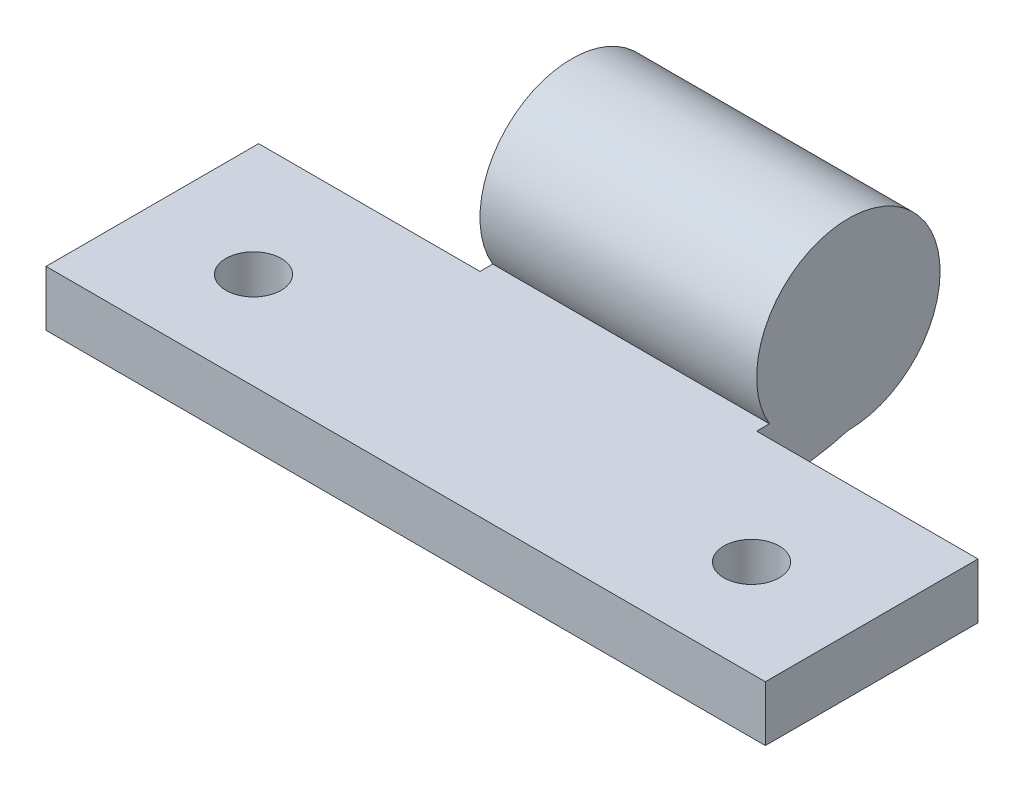
ISO-10303-21;
HEADER;
FILE_DESCRIPTION(('STEP AP214'),'2;1');
FILE_NAME('part.step','',(''),(''),'','','');
FILE_SCHEMA(('AUTOMOTIVE_DESIGN { 1 0 10303 214 1 1 1 1 }'));
ENDSEC;
DATA;
#1=APPLICATION_CONTEXT('core data for automotive mechanical design processes');
#2=APPLICATION_PROTOCOL_DEFINITION('international standard','automotive_design',2000,#1);
#3=PRODUCT_CONTEXT('',#1,'mechanical');
#4=PRODUCT('Part','Part','',(#3));
#5=PRODUCT_RELATED_PRODUCT_CATEGORY('part','',(#4));
#6=PRODUCT_DEFINITION_FORMATION('','',#4);
#7=PRODUCT_DEFINITION_CONTEXT('part definition',#1,'design');
#8=PRODUCT_DEFINITION('design','',#6,#7);
#9=PRODUCT_DEFINITION_SHAPE('','',#8);
#10=(LENGTH_UNIT() NAMED_UNIT(*) SI_UNIT(.MILLI.,.METRE.));
#11=(NAMED_UNIT(*) PLANE_ANGLE_UNIT() SI_UNIT($,.RADIAN.));
#12=(NAMED_UNIT(*) SI_UNIT($,.STERADIAN.) SOLID_ANGLE_UNIT());
#13=UNCERTAINTY_MEASURE_WITH_UNIT(LENGTH_MEASURE(1.E-05),#10,'distance_accuracy_value','');
#14=(GEOMETRIC_REPRESENTATION_CONTEXT(3) GLOBAL_UNCERTAINTY_ASSIGNED_CONTEXT((#13)) GLOBAL_UNIT_ASSIGNED_CONTEXT((#10,
#11,#12)) REPRESENTATION_CONTEXT('',''));
#15=CARTESIAN_POINT('',(0.,0.,0.));
#16=DIRECTION('',(0.,0.,1.));
#17=DIRECTION('',(1.,0.,0.));
#18=AXIS2_PLACEMENT_3D('',#15,#16,#17);
#19=CARTESIAN_POINT('',(0.,2.,0.));
#20=DIRECTION('',(0.,1.,0.));
#21=DIRECTION('',(0.,0.,1.));
#22=AXIS2_PLACEMENT_3D('',#19,#20,#21);
#23=PLANE('',#22);
#24=DIRECTION('',(1.,0.,0.));
#25=VECTOR('',#24,1.);
#26=CARTESIAN_POINT('',(0.,2.,3.315));
#27=LINE('',#26,#25);
#28=CARTESIAN_POINT('',(5.,2.,3.315));
#29=VERTEX_POINT('',#28);
#30=CARTESIAN_POINT('',(13.,2.,3.315));
#31=VERTEX_POINT('',#30);
#32=EDGE_CURVE('E115',#29,#31,#27,.T.);
#33=ORIENTED_EDGE('',*,*,#32,.F.);
#34=DIRECTION('',(0.,0.,1.));
#35=VECTOR('',#34,1.);
#36=CARTESIAN_POINT('',(5.,2.,0.));
#37=LINE('',#36,#35);
#38=CARTESIAN_POINT('',(5.,2.,2.85482048472404));
#39=VERTEX_POINT('',#38);
#40=EDGE_CURVE('E172',#39,#29,#37,.T.);
#41=ORIENTED_EDGE('',*,*,#40,.F.);
#42=DIRECTION('',(1.,0.,0.));
#43=VECTOR('',#42,1.);
#44=CARTESIAN_POINT('',(-22.3762359185336,2.,2.85482048472404));
#45=LINE('',#44,#43);
#46=CARTESIAN_POINT('',(-5.,2.,2.85482048472404));
#47=VERTEX_POINT('',#46);
#48=EDGE_CURVE('E181',#47,#39,#45,.T.);
#49=ORIENTED_EDGE('',*,*,#48,.F.);
#50=DIRECTION('',(0.,0.,-1.));
#51=VECTOR('',#50,1.);
#52=CARTESIAN_POINT('',(-5.,2.,0.));
#53=LINE('',#52,#51);
#54=CARTESIAN_POINT('',(-5.,2.,3.315));
#55=VERTEX_POINT('',#54);
#56=EDGE_CURVE('E175',#55,#47,#53,.T.);
#57=ORIENTED_EDGE('',*,*,#56,.F.);
#58=DIRECTION('',(1.,0.,0.));
#59=VECTOR('',#58,1.);
#60=CARTESIAN_POINT('',(0.,2.,3.315));
#61=LINE('',#60,#59);
#62=CARTESIAN_POINT('',(-13.,2.,3.315));
#63=VERTEX_POINT('',#62);
#64=EDGE_CURVE('E182',#63,#55,#61,.T.);
#65=ORIENTED_EDGE('',*,*,#64,.F.);
#66=DIRECTION('',(0.,0.,1.));
#67=VECTOR('',#66,1.);
#68=CARTESIAN_POINT('',(-13.,2.,11.));
#69=LINE('',#68,#67);
#70=CARTESIAN_POINT('',(-13.,2.,11.));
#71=VERTEX_POINT('',#70);
#72=EDGE_CURVE('E197',#63,#71,#69,.T.);
#73=ORIENTED_EDGE('',*,*,#72,.T.);
#74=DIRECTION('',(1.,0.,0.));
#75=VECTOR('',#74,1.);
#76=CARTESIAN_POINT('',(-13.,2.,11.));
#77=LINE('',#76,#75);
#78=CARTESIAN_POINT('',(13.,2.,11.));
#79=VERTEX_POINT('',#78);
#80=EDGE_CURVE('E144',#71,#79,#77,.T.);
#81=ORIENTED_EDGE('',*,*,#80,.T.);
#82=DIRECTION('',(0.,0.,-1.));
#83=VECTOR('',#82,1.);
#84=CARTESIAN_POINT('',(13.,2.,11.));
#85=LINE('',#84,#83);
#86=EDGE_CURVE('E148',#79,#31,#85,.T.);
#87=ORIENTED_EDGE('',*,*,#86,.T.);
#88=EDGE_LOOP('',(#33,#41,#49,#57,#65,#73,#81,#87));
#89=FACE_BOUND('',#88,.T.);
#90=CARTESIAN_POINT('',(9.,2.,7.5));
#91=DIRECTION('',(0.,1.,0.));
#92=DIRECTION('',(0.,0.,1.));
#93=AXIS2_PLACEMENT_3D('',#90,#91,#92);
#94=CIRCLE('',#93,1.);
#95=CARTESIAN_POINT('',(9.,2.,8.5));
#96=VERTEX_POINT('',#95);
#97=EDGE_CURVE('E136',#96,#96,#94,.T.);
#98=ORIENTED_EDGE('',*,*,#97,.F.);
#99=EDGE_LOOP('',(#98));
#100=FACE_BOUND('',#99,.T.);
#101=CARTESIAN_POINT('',(-9.,2.,7.5));
#102=DIRECTION('',(0.,1.,0.));
#103=DIRECTION('',(0.,0.,-1.));
#104=AXIS2_PLACEMENT_3D('',#101,#102,#103);
#105=CIRCLE('',#104,1.);
#106=CARTESIAN_POINT('',(-9.,2.,6.5));
#107=VERTEX_POINT('',#106);
#108=EDGE_CURVE('E188',#107,#107,#105,.T.);
#109=ORIENTED_EDGE('',*,*,#108,.F.);
#110=EDGE_LOOP('',(#109));
#111=FACE_BOUND('',#110,.T.);
#112=ADVANCED_FACE('F38',(#89,#100,#111),#23,.T.);
#113=CARTESIAN_POINT('',(0.,0.,0.));
#114=DIRECTION('',(0.,1.,0.));
#115=DIRECTION('',(0.,0.,1.));
#116=AXIS2_PLACEMENT_3D('',#113,#114,#115);
#117=PLANE('',#116);
#118=DIRECTION('',(0.,0.,1.));
#119=VECTOR('',#118,1.);
#120=CARTESIAN_POINT('',(5.,0.,3.315));
#121=LINE('',#120,#119);
#122=CARTESIAN_POINT('',(5.,0.,2.69501391462086));
#123=VERTEX_POINT('',#122);
#124=CARTESIAN_POINT('',(5.,0.,3.315));
#125=VERTEX_POINT('',#124);
#126=EDGE_CURVE('E60',#123,#125,#121,.T.);
#127=ORIENTED_EDGE('',*,*,#126,.T.);
#128=DIRECTION('',(1.,0.,0.));
#129=VECTOR('',#128,1.);
#130=CARTESIAN_POINT('',(13.,0.,3.315));
#131=LINE('',#130,#129);
#132=CARTESIAN_POINT('',(13.,0.,3.315));
#133=VERTEX_POINT('',#132);
#134=EDGE_CURVE('E113',#125,#133,#131,.T.);
#135=ORIENTED_EDGE('',*,*,#134,.T.);
#136=DIRECTION('',(0.,0.,-1.));
#137=VECTOR('',#136,1.);
#138=CARTESIAN_POINT('',(13.,0.,11.));
#139=LINE('',#138,#137);
#140=CARTESIAN_POINT('',(13.,0.,11.));
#141=VERTEX_POINT('',#140);
#142=EDGE_CURVE('E127',#141,#133,#139,.T.);
#143=ORIENTED_EDGE('',*,*,#142,.F.);
#144=DIRECTION('',(1.,0.,0.));
#145=VECTOR('',#144,1.);
#146=CARTESIAN_POINT('',(-13.,0.,11.));
#147=LINE('',#146,#145);
#148=CARTESIAN_POINT('',(-13.,0.,11.));
#149=VERTEX_POINT('',#148);
#150=EDGE_CURVE('E138',#149,#141,#147,.T.);
#151=ORIENTED_EDGE('',*,*,#150,.F.);
#152=DIRECTION('',(0.,0.,1.));
#153=VECTOR('',#152,1.);
#154=CARTESIAN_POINT('',(-13.,0.,11.));
#155=LINE('',#154,#153);
#156=CARTESIAN_POINT('',(-13.,0.,3.315));
#157=VERTEX_POINT('',#156);
#158=EDGE_CURVE('E135',#157,#149,#155,.T.);
#159=ORIENTED_EDGE('',*,*,#158,.F.);
#160=DIRECTION('',(1.,0.,0.));
#161=VECTOR('',#160,1.);
#162=CARTESIAN_POINT('',(-13.,0.,3.315));
#163=LINE('',#162,#161);
#164=CARTESIAN_POINT('',(-5.,0.,3.315));
#165=VERTEX_POINT('',#164);
#166=EDGE_CURVE('E165',#157,#165,#163,.T.);
#167=ORIENTED_EDGE('',*,*,#166,.T.);
#168=DIRECTION('',(0.,0.,-1.));
#169=VECTOR('',#168,1.);
#170=CARTESIAN_POINT('',(-5.,0.,3.315));
#171=LINE('',#170,#169);
#172=CARTESIAN_POINT('',(-5.,0.,2.69501391462086));
#173=VERTEX_POINT('',#172);
#174=EDGE_CURVE('E158',#165,#173,#171,.T.);
#175=ORIENTED_EDGE('',*,*,#174,.T.);
#176=DIRECTION('',(1.,0.,0.));
#177=VECTOR('',#176,1.);
#178=CARTESIAN_POINT('',(0.,0.,2.69501391462086));
#179=LINE('',#178,#177);
#180=EDGE_CURVE('E153',#173,#123,#179,.T.);
#181=ORIENTED_EDGE('',*,*,#180,.T.);
#182=EDGE_LOOP('',(#127,#135,#143,#151,#159,#167,#175,#181));
#183=FACE_BOUND('',#182,.T.);
#184=CARTESIAN_POINT('',(9.,0.,7.5));
#185=DIRECTION('',(0.,1.,0.));
#186=DIRECTION('',(0.,0.,1.));
#187=AXIS2_PLACEMENT_3D('',#184,#185,#186);
#188=CIRCLE('',#187,1.);
#189=CARTESIAN_POINT('',(9.,0.,8.5));
#190=VERTEX_POINT('',#189);
#191=EDGE_CURVE('E141',#190,#190,#188,.T.);
#192=ORIENTED_EDGE('',*,*,#191,.T.);
#193=EDGE_LOOP('',(#192));
#194=FACE_BOUND('',#193,.T.);
#195=CARTESIAN_POINT('',(-9.,0.,7.5));
#196=DIRECTION('',(0.,1.,0.));
#197=DIRECTION('',(0.,0.,-1.));
#198=AXIS2_PLACEMENT_3D('',#195,#196,#197);
#199=CIRCLE('',#198,1.);
#200=CARTESIAN_POINT('',(-9.,0.,6.5));
#201=VERTEX_POINT('',#200);
#202=EDGE_CURVE('E185',#201,#201,#199,.T.);
#203=ORIENTED_EDGE('',*,*,#202,.T.);
#204=EDGE_LOOP('',(#203));
#205=FACE_BOUND('',#204,.T.);
#206=ADVANCED_FACE('F124',(#183,#194,#205),#117,.F.);
#207=CARTESIAN_POINT('',(13.,2.,11.));
#208=DIRECTION('',(-1.,0.,0.));
#209=DIRECTION('',(0.,0.,1.));
#210=AXIS2_PLACEMENT_3D('',#207,#208,#209);
#211=PLANE('',#210);
#212=ORIENTED_EDGE('',*,*,#142,.T.);
#213=DIRECTION('',(0.,1.,0.));
#214=VECTOR('',#213,1.);
#215=CARTESIAN_POINT('',(13.,0.,3.315));
#216=LINE('',#215,#214);
#217=EDGE_CURVE('E109',#133,#31,#216,.T.);
#218=ORIENTED_EDGE('',*,*,#217,.T.);
#219=ORIENTED_EDGE('',*,*,#86,.F.);
#220=DIRECTION('',(0.,-1.,0.));
#221=VECTOR('',#220,1.);
#222=CARTESIAN_POINT('',(13.,2.,11.));
#223=LINE('',#222,#221);
#224=EDGE_CURVE('E134',#79,#141,#223,.T.);
#225=ORIENTED_EDGE('',*,*,#224,.T.);
#226=EDGE_LOOP('',(#212,#218,#219,#225));
#227=FACE_BOUND('',#226,.T.);
#228=ADVANCED_FACE('F132',(#227),#211,.F.);
#229=CARTESIAN_POINT('',(-13.,2.,11.));
#230=DIRECTION('',(1.,0.,0.));
#231=DIRECTION('',(0.,0.,-1.));
#232=AXIS2_PLACEMENT_3D('',#229,#230,#231);
#233=PLANE('',#232);
#234=ORIENTED_EDGE('',*,*,#72,.F.);
#235=DIRECTION('',(0.,1.,0.));
#236=VECTOR('',#235,1.);
#237=CARTESIAN_POINT('',(-13.,0.,3.315));
#238=LINE('',#237,#236);
#239=EDGE_CURVE('E166',#157,#63,#238,.T.);
#240=ORIENTED_EDGE('',*,*,#239,.F.);
#241=ORIENTED_EDGE('',*,*,#158,.T.);
#242=DIRECTION('',(0.,-1.,0.));
#243=VECTOR('',#242,1.);
#244=CARTESIAN_POINT('',(-13.,2.,11.));
#245=LINE('',#244,#243);
#246=EDGE_CURVE('E150',#71,#149,#245,.T.);
#247=ORIENTED_EDGE('',*,*,#246,.F.);
#248=EDGE_LOOP('',(#234,#240,#241,#247));
#249=FACE_BOUND('',#248,.T.);
#250=ADVANCED_FACE('F206',(#249),#233,.F.);
#251=CARTESIAN_POINT('',(-13.,2.,11.));
#252=DIRECTION('',(0.,0.,-1.));
#253=DIRECTION('',(-1.,0.,0.));
#254=AXIS2_PLACEMENT_3D('',#251,#252,#253);
#255=PLANE('',#254);
#256=ORIENTED_EDGE('',*,*,#150,.T.);
#257=ORIENTED_EDGE('',*,*,#224,.F.);
#258=ORIENTED_EDGE('',*,*,#80,.F.);
#259=ORIENTED_EDGE('',*,*,#246,.T.);
#260=EDGE_LOOP('',(#256,#257,#258,#259));
#261=FACE_BOUND('',#260,.T.);
#262=ADVANCED_FACE('F203',(#261),#255,.F.);
#263=CARTESIAN_POINT('',(9.,2.,7.5));
#264=DIRECTION('',(0.,-1.,0.));
#265=DIRECTION('',(0.,0.,-1.));
#266=AXIS2_PLACEMENT_3D('',#263,#264,#265);
#267=CYLINDRICAL_SURFACE('',#266,1.);
#268=ORIENTED_EDGE('',*,*,#97,.T.);
#269=EDGE_LOOP('',(#268));
#270=FACE_BOUND('',#269,.T.);
#271=ORIENTED_EDGE('',*,*,#191,.F.);
#272=EDGE_LOOP('',(#271));
#273=FACE_BOUND('',#272,.T.);
#274=ADVANCED_FACE('F232',(#270,#273),#267,.F.);
#275=CARTESIAN_POINT('',(-9.,2.,7.5));
#276=DIRECTION('',(0.,-1.,0.));
#277=DIRECTION('',(0.,0.,-1.));
#278=AXIS2_PLACEMENT_3D('',#275,#276,#277);
#279=CYLINDRICAL_SURFACE('',#278,1.);
#280=ORIENTED_EDGE('',*,*,#108,.T.);
#281=EDGE_LOOP('',(#280));
#282=FACE_BOUND('',#281,.T.);
#283=ORIENTED_EDGE('',*,*,#202,.F.);
#284=EDGE_LOOP('',(#283));
#285=FACE_BOUND('',#284,.T.);
#286=ADVANCED_FACE('F258',(#282,#285),#279,.F.);
#287=CARTESIAN_POINT('',(-22.3762359185336,3.685,0.));
#288=DIRECTION('',(1.,0.,0.));
#289=DIRECTION('',(0.,0.,-1.));
#290=AXIS2_PLACEMENT_3D('',#287,#288,#289);
#291=CYLINDRICAL_SURFACE('',#290,3.315);
#292=CARTESIAN_POINT('',(5.,3.685,0.));
#293=DIRECTION('',(-1.,0.,0.));
#294=DIRECTION('',(0.,0.,1.));
#295=AXIS2_PLACEMENT_3D('',#292,#293,#294);
#296=CIRCLE('',#295,3.315);
#297=CARTESIAN_POINT('',(5.,0.370000000000001,0.));
#298=VERTEX_POINT('',#297);
#299=EDGE_CURVE('E170',#298,#39,#296,.F.);
#300=ORIENTED_EDGE('',*,*,#299,.F.);
#301=DIRECTION('',(1.,0.,0.));
#302=VECTOR('',#301,1.);
#303=CARTESIAN_POINT('',(-22.3762359185336,0.370000000000001,0.));
#304=LINE('',#303,#302);
#305=CARTESIAN_POINT('',(-5.,0.370000000000001,0.));
#306=VERTEX_POINT('',#305);
#307=EDGE_CURVE('E168',#306,#298,#304,.T.);
#308=ORIENTED_EDGE('',*,*,#307,.F.);
#309=CARTESIAN_POINT('',(-5.,3.685,0.));
#310=DIRECTION('',(1.,0.,0.));
#311=DIRECTION('',(0.,0.,-1.));
#312=AXIS2_PLACEMENT_3D('',#309,#310,#311);
#313=CIRCLE('',#312,3.315);
#314=EDGE_CURVE('E53',#47,#306,#313,.F.);
#315=ORIENTED_EDGE('',*,*,#314,.F.);
#316=ORIENTED_EDGE('',*,*,#48,.T.);
#317=EDGE_LOOP('',(#300,#308,#315,#316));
#318=FACE_BOUND('',#317,.T.);
#319=ADVANCED_FACE('F184',(#318),#291,.T.);
#320=CARTESIAN_POINT('',(-22.3762359185336,10.,2.69501391462086));
#321=DIRECTION('',(1.,0.,0.));
#322=DIRECTION('',(0.,0.,-1.));
#323=AXIS2_PLACEMENT_3D('',#320,#321,#322);
#324=CYLINDRICAL_SURFACE('',#323,10.);
#325=CARTESIAN_POINT('',(5.,10.,2.69501391462086));
#326=DIRECTION('',(-1.,0.,0.));
#327=DIRECTION('',(0.,0.,1.));
#328=AXIS2_PLACEMENT_3D('',#325,#326,#327);
#329=CIRCLE('',#328,10.);
#330=EDGE_CURVE('E11',#123,#298,#329,.F.);
#331=ORIENTED_EDGE('',*,*,#330,.F.);
#332=ORIENTED_EDGE('',*,*,#180,.F.);
#333=CARTESIAN_POINT('',(-5.,10.,2.69501391462086));
#334=DIRECTION('',(1.,0.,0.));
#335=DIRECTION('',(0.,0.,-1.));
#336=AXIS2_PLACEMENT_3D('',#333,#334,#335);
#337=CIRCLE('',#336,10.);
#338=EDGE_CURVE('E46',#306,#173,#337,.F.);
#339=ORIENTED_EDGE('',*,*,#338,.F.);
#340=ORIENTED_EDGE('',*,*,#307,.T.);
#341=EDGE_LOOP('',(#331,#332,#339,#340));
#342=FACE_BOUND('',#341,.T.);
#343=ADVANCED_FACE('F40',(#342),#324,.T.);
#344=CARTESIAN_POINT('',(-13.,0.,3.315));
#345=DIRECTION('',(0.,0.,1.));
#346=DIRECTION('',(1.,0.,0.));
#347=AXIS2_PLACEMENT_3D('',#344,#345,#346);
#348=PLANE('',#347);
#349=ORIENTED_EDGE('',*,*,#64,.T.);
#350=DIRECTION('',(0.,1.,0.));
#351=VECTOR('',#350,1.);
#352=CARTESIAN_POINT('',(-5.,0.,3.315));
#353=LINE('',#352,#351);
#354=EDGE_CURVE('E129',#165,#55,#353,.T.);
#355=ORIENTED_EDGE('',*,*,#354,.F.);
#356=ORIENTED_EDGE('',*,*,#166,.F.);
#357=ORIENTED_EDGE('',*,*,#239,.T.);
#358=EDGE_LOOP('',(#349,#355,#356,#357));
#359=FACE_BOUND('',#358,.T.);
#360=ADVANCED_FACE('F213',(#359),#348,.F.);
#361=CARTESIAN_POINT('',(-5.,0.,3.315));
#362=DIRECTION('',(1.,0.,0.));
#363=DIRECTION('',(0.,0.,-1.));
#364=AXIS2_PLACEMENT_3D('',#361,#362,#363);
#365=PLANE('',#364);
#366=ORIENTED_EDGE('',*,*,#56,.T.);
#367=ORIENTED_EDGE('',*,*,#314,.T.);
#368=ORIENTED_EDGE('',*,*,#338,.T.);
#369=ORIENTED_EDGE('',*,*,#174,.F.);
#370=ORIENTED_EDGE('',*,*,#354,.T.);
#371=EDGE_LOOP('',(#366,#367,#368,#369,#370));
#372=FACE_BOUND('',#371,.T.);
#373=ADVANCED_FACE('F156',(#372),#365,.F.);
#374=CARTESIAN_POINT('',(13.,0.,3.315));
#375=DIRECTION('',(0.,0.,1.));
#376=DIRECTION('',(1.,0.,0.));
#377=AXIS2_PLACEMENT_3D('',#374,#375,#376);
#378=PLANE('',#377);
#379=ORIENTED_EDGE('',*,*,#32,.T.);
#380=ORIENTED_EDGE('',*,*,#217,.F.);
#381=ORIENTED_EDGE('',*,*,#134,.F.);
#382=DIRECTION('',(0.,1.,0.));
#383=VECTOR('',#382,1.);
#384=CARTESIAN_POINT('',(5.,0.,3.315));
#385=LINE('',#384,#383);
#386=EDGE_CURVE('E120',#125,#29,#385,.T.);
#387=ORIENTED_EDGE('',*,*,#386,.T.);
#388=EDGE_LOOP('',(#379,#380,#381,#387));
#389=FACE_BOUND('',#388,.T.);
#390=ADVANCED_FACE('F111',(#389),#378,.F.);
#391=CARTESIAN_POINT('',(5.,0.,3.315));
#392=DIRECTION('',(-1.,0.,0.));
#393=DIRECTION('',(0.,0.,1.));
#394=AXIS2_PLACEMENT_3D('',#391,#392,#393);
#395=PLANE('',#394);
#396=ORIENTED_EDGE('',*,*,#40,.T.);
#397=ORIENTED_EDGE('',*,*,#386,.F.);
#398=ORIENTED_EDGE('',*,*,#126,.F.);
#399=ORIENTED_EDGE('',*,*,#330,.T.);
#400=ORIENTED_EDGE('',*,*,#299,.T.);
#401=EDGE_LOOP('',(#396,#397,#398,#399,#400));
#402=FACE_BOUND('',#401,.T.);
#403=ADVANCED_FACE('F169',(#402),#395,.F.);
#404=CLOSED_SHELL('',(#112,#206,#228,#250,#262,#274,#286,#319,#343,#360,#373,#390,#403));
#405=MANIFOLD_SOLID_BREP('B2',#404);
#406=ADVANCED_BREP_SHAPE_REPRESENTATION('',(#18,#405),#14);
#407=SHAPE_DEFINITION_REPRESENTATION(#9,#406);
ENDSEC;
END-ISO-10303-21;
